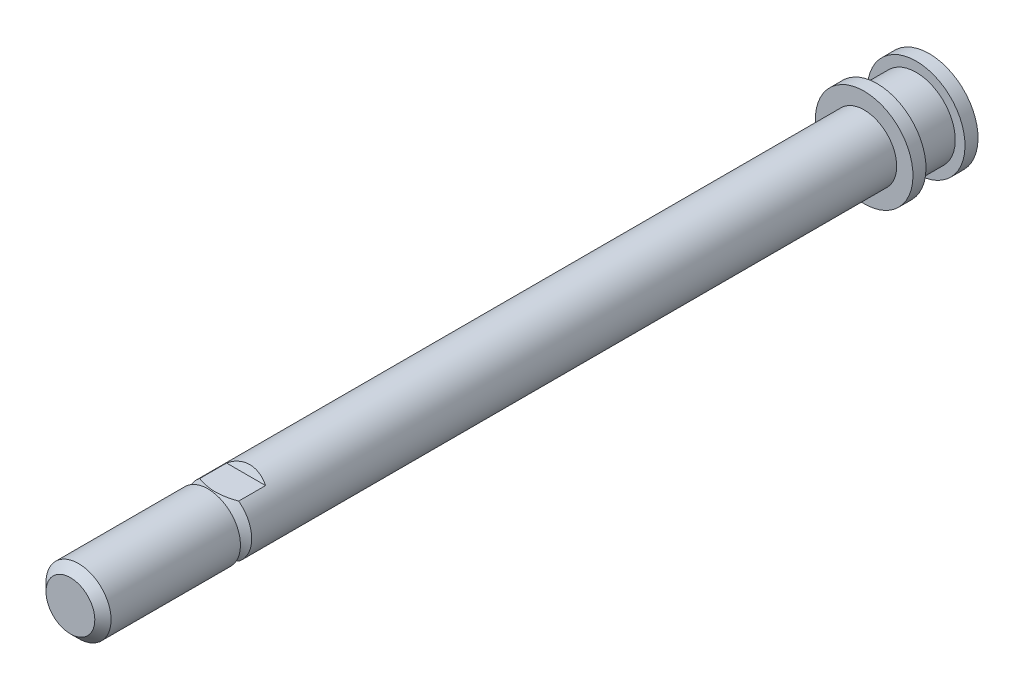
ISO-10303-21;
HEADER;
FILE_DESCRIPTION(('STEP AP214'),'2;1');
FILE_NAME('part.step','',(''),(''),'','','');
FILE_SCHEMA(('AUTOMOTIVE_DESIGN { 1 0 10303 214 1 1 1 1 }'));
ENDSEC;
DATA;
#1=APPLICATION_CONTEXT('core data for automotive mechanical design processes');
#2=APPLICATION_PROTOCOL_DEFINITION('international standard','automotive_design',2000,#1);
#3=PRODUCT_CONTEXT('',#1,'mechanical');
#4=PRODUCT('Part','Part','',(#3));
#5=PRODUCT_RELATED_PRODUCT_CATEGORY('part','',(#4));
#6=PRODUCT_DEFINITION_FORMATION('','',#4);
#7=PRODUCT_DEFINITION_CONTEXT('part definition',#1,'design');
#8=PRODUCT_DEFINITION('design','',#6,#7);
#9=PRODUCT_DEFINITION_SHAPE('','',#8);
#10=(LENGTH_UNIT() NAMED_UNIT(*) SI_UNIT(.MILLI.,.METRE.));
#11=(NAMED_UNIT(*) PLANE_ANGLE_UNIT() SI_UNIT($,.RADIAN.));
#12=(NAMED_UNIT(*) SI_UNIT($,.STERADIAN.) SOLID_ANGLE_UNIT());
#13=UNCERTAINTY_MEASURE_WITH_UNIT(LENGTH_MEASURE(1.E-05),#10,'distance_accuracy_value','');
#14=(GEOMETRIC_REPRESENTATION_CONTEXT(3) GLOBAL_UNCERTAINTY_ASSIGNED_CONTEXT((#13)) GLOBAL_UNIT_ASSIGNED_CONTEXT((#10,
#11,#12)) REPRESENTATION_CONTEXT('',''));
#15=CARTESIAN_POINT('',(0.,0.,0.));
#16=DIRECTION('',(0.,0.,1.));
#17=DIRECTION('',(1.,0.,0.));
#18=AXIS2_PLACEMENT_3D('',#15,#16,#17);
#19=CARTESIAN_POINT('',(0.,5.99999999999999,-102.));
#20=DIRECTION('',(0.,0.,-0.999999999999997));
#21=DIRECTION('',(0.,0.999999999999998,0.));
#22=AXIS2_PLACEMENT_3D('',#19,#20,#21);
#23=PLANE('',#22);
#24=CARTESIAN_POINT('',(0.,0.,-102.));
#25=DIRECTION('',(0.,0.,-0.999999999999997));
#26=DIRECTION('',(0.,0.999999999999998,0.));
#27=AXIS2_PLACEMENT_3D('',#24,#25,#26);
#28=CIRCLE('',#27,7.50000000000001);
#29=CARTESIAN_POINT('',(0.,7.5,-102.));
#30=VERTEX_POINT('',#29);
#31=EDGE_CURVE('E160',#30,#30,#28,.T.);
#32=ORIENTED_EDGE('',*,*,#31,.T.);
#33=EDGE_LOOP('',(#32));
#34=FACE_BOUND('',#33,.T.);
#35=CARTESIAN_POINT('',(0.,0.,-102.));
#36=DIRECTION('',(0.,0.,-0.999999999999997));
#37=DIRECTION('',(0.,0.999999999999998,0.));
#38=AXIS2_PLACEMENT_3D('',#35,#36,#37);
#39=CIRCLE('',#38,6.00000000000001);
#40=CARTESIAN_POINT('',(0.,6.,-102.));
#41=VERTEX_POINT('',#40);
#42=EDGE_CURVE('E248',#41,#41,#39,.T.);
#43=ORIENTED_EDGE('',*,*,#42,.F.);
#44=EDGE_LOOP('',(#43));
#45=FACE_BOUND('',#44,.T.);
#46=ADVANCED_FACE('F43',(#34,#45),#23,.T.);
#47=CARTESIAN_POINT('',(0.,0.,21.9999999999999));
#48=DIRECTION('',(0.,0.,-0.999999999999997));
#49=DIRECTION('',(0.,0.999999999999998,0.));
#50=AXIS2_PLACEMENT_3D('',#47,#48,#49);
#51=CYLINDRICAL_SURFACE('',#50,6.00000000000001);
#52=ORIENTED_EDGE('',*,*,#42,.T.);
#53=EDGE_LOOP('',(#52));
#54=FACE_BOUND('',#53,.T.);
#55=CARTESIAN_POINT('',(0.,0.,-108.));
#56=DIRECTION('',(0.,0.,-0.999999999999997));
#57=DIRECTION('',(0.,0.999999999999998,0.));
#58=AXIS2_PLACEMENT_3D('',#55,#56,#57);
#59=CIRCLE('',#58,6.00000000000001);
#60=CARTESIAN_POINT('',(0.,6.,-108.));
#61=VERTEX_POINT('',#60);
#62=EDGE_CURVE('E245',#61,#61,#59,.T.);
#63=ORIENTED_EDGE('',*,*,#62,.F.);
#64=EDGE_LOOP('',(#63));
#65=FACE_BOUND('',#64,.T.);
#66=ADVANCED_FACE('F183',(#54,#65),#51,.T.);
#67=CARTESIAN_POINT('',(0.,5.99999999999998,-108.));
#68=DIRECTION('',(0.,0.,0.999999999999997));
#69=DIRECTION('',(0.,-0.999999999999998,0.));
#70=AXIS2_PLACEMENT_3D('',#67,#68,#69);
#71=PLANE('',#70);
#72=ORIENTED_EDGE('',*,*,#62,.T.);
#73=EDGE_LOOP('',(#72));
#74=FACE_BOUND('',#73,.T.);
#75=CARTESIAN_POINT('',(0.,0.,-108.));
#76=DIRECTION('',(0.,0.,-0.999999999999997));
#77=DIRECTION('',(0.,0.999999999999998,0.));
#78=AXIS2_PLACEMENT_3D('',#75,#76,#77);
#79=CIRCLE('',#78,7.50000000000001);
#80=CARTESIAN_POINT('',(0.,7.5,-108.));
#81=VERTEX_POINT('',#80);
#82=EDGE_CURVE('E226',#81,#81,#79,.T.);
#83=ORIENTED_EDGE('',*,*,#82,.F.);
#84=EDGE_LOOP('',(#83));
#85=FACE_BOUND('',#84,.T.);
#86=ADVANCED_FACE('F188',(#74,#85),#71,.T.);
#87=CARTESIAN_POINT('',(0.,0.,21.9999999999999));
#88=DIRECTION('',(0.,0.,-0.999999999999997));
#89=DIRECTION('',(0.,0.999999999999998,0.));
#90=AXIS2_PLACEMENT_3D('',#87,#88,#89);
#91=CYLINDRICAL_SURFACE('',#90,7.50000000000001);
#92=ORIENTED_EDGE('',*,*,#82,.T.);
#93=EDGE_LOOP('',(#92));
#94=FACE_BOUND('',#93,.T.);
#95=CARTESIAN_POINT('',(0.,0.,-110.));
#96=DIRECTION('',(0.,0.,-0.999999999999997));
#97=DIRECTION('',(0.,0.999999999999998,0.));
#98=AXIS2_PLACEMENT_3D('',#95,#96,#97);
#99=CIRCLE('',#98,7.50000000000001);
#100=CARTESIAN_POINT('',(0.,7.5,-110.));
#101=VERTEX_POINT('',#100);
#102=EDGE_CURVE('E222',#101,#101,#99,.T.);
#103=ORIENTED_EDGE('',*,*,#102,.F.);
#104=EDGE_LOOP('',(#103));
#105=FACE_BOUND('',#104,.T.);
#106=ADVANCED_FACE('F196',(#94,#105),#91,.T.);
#107=CARTESIAN_POINT('',(0.,7.49999999999999,-109.999999999999));
#108=DIRECTION('',(0.,0.,-0.999999999999997));
#109=DIRECTION('',(0.,0.999999999999998,0.));
#110=AXIS2_PLACEMENT_3D('',#107,#108,#109);
#111=PLANE('',#110);
#112=ORIENTED_EDGE('',*,*,#102,.T.);
#113=EDGE_LOOP('',(#112));
#114=FACE_BOUND('',#113,.T.);
#115=ADVANCED_FACE('F200',(#114),#111,.T.);
#116=CARTESIAN_POINT('',(0.,4.99999999999996,21.9999999999999));
#117=DIRECTION('',(0.,0.,0.999999999999997));
#118=DIRECTION('',(0.,-0.999999999999998,0.));
#119=AXIS2_PLACEMENT_3D('',#116,#117,#118);
#120=PLANE('',#119);
#121=CARTESIAN_POINT('',(0.,0.,21.9999999999999));
#122=DIRECTION('',(0.,0.,0.999999999999997));
#123=DIRECTION('',(0.,-0.999999999999998,0.));
#124=AXIS2_PLACEMENT_3D('',#121,#122,#123);
#125=CIRCLE('',#124,3.75);
#126=CARTESIAN_POINT('',(0.,-3.75000000000002,21.9999999999999));
#127=VERTEX_POINT('',#126);
#128=EDGE_CURVE('E251',#127,#127,#125,.T.);
#129=ORIENTED_EDGE('',*,*,#128,.T.);
#130=EDGE_LOOP('',(#129));
#131=FACE_BOUND('',#130,.T.);
#132=ADVANCED_FACE('F204',(#131),#120,.T.);
#133=CARTESIAN_POINT('',(0.,0.,21.9999999999999));
#134=DIRECTION('',(0.,0.,-0.999999999999997));
#135=DIRECTION('',(0.,0.999999999999998,0.));
#136=AXIS2_PLACEMENT_3D('',#133,#134,#135);
#137=CYLINDRICAL_SURFACE('',#136,5.);
#138=CARTESIAN_POINT('',(0.,0.,20.7499999999999));
#139=DIRECTION('',(0.,0.,0.999999999999997));
#140=DIRECTION('',(0.,-0.999999999999998,0.));
#141=AXIS2_PLACEMENT_3D('',#138,#139,#140);
#142=CIRCLE('',#141,5.);
#143=CARTESIAN_POINT('',(0.,-4.99999999999999,20.7499999999999));
#144=VERTEX_POINT('',#143);
#145=EDGE_CURVE('E218',#144,#144,#142,.F.);
#146=ORIENTED_EDGE('',*,*,#145,.T.);
#147=EDGE_LOOP('',(#146));
#148=FACE_BOUND('',#147,.T.);
#149=CARTESIAN_POINT('',(0.,0.,0.866025403784436));
#150=DIRECTION('',(0.,0.,-0.999999999999997));
#151=DIRECTION('',(0.,0.999999999999998,0.));
#152=AXIS2_PLACEMENT_3D('',#149,#150,#151);
#153=CIRCLE('',#152,5.);
#154=CARTESIAN_POINT('',(0.,4.99999999999996,0.866025403784436));
#155=VERTEX_POINT('',#154);
#156=EDGE_CURVE('E113',#155,#155,#153,.T.);
#157=ORIENTED_EDGE('',*,*,#156,.F.);
#158=EDGE_LOOP('',(#157));
#159=FACE_BOUND('',#158,.T.);
#160=ADVANCED_FACE('F207',(#148,#159),#137,.T.);
#161=CARTESIAN_POINT('',(0.,0.,0.));
#162=DIRECTION('',(0.,0.,0.999999999999997));
#163=DIRECTION('',(0.,-0.999999999999998,0.));
#164=AXIS2_PLACEMENT_3D('',#161,#162,#163);
#165=CONICAL_SURFACE('',#164,3.5,1.0471975511966);
#166=ORIENTED_EDGE('',*,*,#156,.T.);
#167=EDGE_LOOP('',(#166));
#168=FACE_BOUND('',#167,.T.);
#169=CARTESIAN_POINT('',(0.,0.,0.));
#170=DIRECTION('',(0.,0.,-0.999999999999997));
#171=DIRECTION('',(0.,0.999999999999998,0.));
#172=AXIS2_PLACEMENT_3D('',#169,#170,#171);
#173=CIRCLE('',#172,3.5);
#174=CARTESIAN_POINT('',(0.,3.49999999999999,0.));
#175=VERTEX_POINT('',#174);
#176=EDGE_CURVE('E106',#175,#175,#173,.T.);
#177=ORIENTED_EDGE('',*,*,#176,.F.);
#178=EDGE_LOOP('',(#177));
#179=FACE_BOUND('',#178,.T.);
#180=ADVANCED_FACE('F150',(#168,#179),#165,.T.);
#181=CARTESIAN_POINT('',(0.,0.,-0.866025403784436));
#182=DIRECTION('',(0.,0.,-0.999999999999997));
#183=DIRECTION('',(0.,0.999999999999998,0.));
#184=AXIS2_PLACEMENT_3D('',#181,#182,#183);
#185=CONICAL_SURFACE('',#184,5.,1.0471975511966);
#186=CARTESIAN_POINT('',(-7.86180531631576,-3.99999999999999,-3.07201342650786));
#187=CARTESIAN_POINT('',(-7.66849783291229,-4.,-2.97255785903638));
#188=CARTESIAN_POINT('',(-7.47489348324044,-4.,-2.87367352660735));
#189=CARTESIAN_POINT('',(-7.08693733130927,-4.,-2.67735283423473));
#190=CARTESIAN_POINT('',(-6.89258548316763,-4.,-2.57991656501987));
#191=CARTESIAN_POINT('',(-6.50253870557746,-4.,-2.3865790063191));
#192=CARTESIAN_POINT('',(-6.30684167537375,-4.,-2.29068194658669));
#193=CARTESIAN_POINT('',(-5.91438194712675,-4.,-2.10110016384248));
#194=CARTESIAN_POINT('',(-5.71761927144131,-4.,-2.00741539463491));
#195=CARTESIAN_POINT('',(-5.31188234613882,-4.,-1.81772586953452));
#196=CARTESIAN_POINT('',(-5.10283407662063,-4.,-1.72187894602038));
#197=CARTESIAN_POINT('',(-4.68294809460555,-4.,-1.53419232714763));
#198=CARTESIAN_POINT('',(-4.4721104566303,-4.,-1.44235246587611));
#199=CARTESIAN_POINT('',(-4.04839019523099,-4.,-1.26400841550776));
#200=CARTESIAN_POINT('',(-3.83550945250582,-4.,-1.17749977872146));
#201=CARTESIAN_POINT('',(-3.40703640498029,-4.,-1.01147021946431));
#202=CARTESIAN_POINT('',(-3.19144446602495,-4.,-0.93194836553082));
#203=CARTESIAN_POINT('',(-2.86682003418749,-4.,-0.820122790813222));
#204=CARTESIAN_POINT('',(-2.75900888063991,-4.,-0.784269612933996));
#205=CARTESIAN_POINT('',(-2.54254458871374,-4.,-0.715231164220834));
#206=CARTESIAN_POINT('',(-2.4338915384743,-4.,-0.682045618138763));
#207=CARTESIAN_POINT('',(-2.21569487510074,-4.,-0.618744655010836));
#208=CARTESIAN_POINT('',(-2.10615131658531,-4.,-0.588629051183516));
#209=CARTESIAN_POINT('',(-1.88612589337538,-4.,-0.531904383792931));
#210=CARTESIAN_POINT('',(-1.77564371074434,-4.,-0.505296563284953));
#211=CARTESIAN_POINT('',(-1.44711223291784,-4.,-0.432426746940943));
#212=CARTESIAN_POINT('',(-1.22772857108909,-4.,-0.391851475925098));
#213=CARTESIAN_POINT('',(-0.896718914259909,-4.,-0.345186425852213));
#214=CARTESIAN_POINT('',(-0.78606530877941,-4.,-0.331998008184884));
#215=CARTESIAN_POINT('',(-0.564275526815935,-4.00000000000001,-0.310687180977873));
#216=CARTESIAN_POINT('',(-0.453139407237403,-4.00000000000002,-0.302564189565984));
#217=CARTESIAN_POINT('',(-0.207986106995854,-4.00000000000002,-0.290513192238038));
#218=CARTESIAN_POINT('',(-0.0739085918515131,-4.00000000000001,-0.287773095122356));
#219=CARTESIAN_POINT('',(0.194164625889308,-4.,-0.290098979540162));
#220=CARTESIAN_POINT('',(0.328160334374401,-4.,-0.295164310324421));
#221=CARTESIAN_POINT('',(0.595679766821111,-4.,-0.312881287785485));
#222=CARTESIAN_POINT('',(0.729203352618719,-4.,-0.3255349957655));
#223=CARTESIAN_POINT('',(0.9953865189933,-4.,-0.357919123345342));
#224=CARTESIAN_POINT('',(1.12804604919258,-4.,-0.377649951873316));
#225=CARTESIAN_POINT('',(1.39584151797719,-4.,-0.424106338324262));
#226=CARTESIAN_POINT('',(1.53094669116172,-4.,-0.451007526348123));
#227=CARTESIAN_POINT('',(1.79984416307208,-4.,-0.510678528461073));
#228=CARTESIAN_POINT('',(1.93363644000737,-4.,-0.54344843978193));
#229=CARTESIAN_POINT('',(2.19993298599708,-4.,-0.614022519162697));
#230=CARTESIAN_POINT('',(2.33243672851021,-4.,-0.651828659510102));
#231=CARTESIAN_POINT('',(2.59614009587179,-4.,-0.731688565375959));
#232=CARTESIAN_POINT('',(2.72733979406205,-4.00000000000001,-0.773742090511944));
#233=CARTESIAN_POINT('',(3.1040542951842,-4.00000000000002,-0.900171474432146));
#234=CARTESIAN_POINT('',(3.34804582505432,-4.00000000000001,-0.989083401695573));
#235=CARTESIAN_POINT('',(3.83256488220362,-3.99999999999999,-1.17594439660714));
#236=CARTESIAN_POINT('',(4.07309137139441,-4.,-1.27389610995749));
#237=CARTESIAN_POINT('',(4.55159278263701,-4.,-1.47644059627485));
#238=CARTESIAN_POINT('',(4.78956498601692,-4.,-1.58103975594987));
#239=CARTESIAN_POINT('',(5.26329012994213,-4.,-1.79505278662576));
#240=CARTESIAN_POINT('',(5.49904331167755,-4.,-1.90446612685284));
#241=CARTESIAN_POINT('',(5.96962544513929,-4.,-2.1272961973532));
#242=CARTESIAN_POINT('',(6.20444853422911,-4.,-2.24072526781709));
#243=CARTESIAN_POINT('',(6.67272720981115,-4.,-2.47037781090189));
#244=CARTESIAN_POINT('',(6.90618276546626,-4.,-2.58660134623705));
#245=CARTESIAN_POINT('',(7.37186635654456,-4.,-2.82115637848403));
#246=CARTESIAN_POINT('',(7.60409500728959,-4.,-2.93948665588895));
#247=CARTESIAN_POINT('',(8.06766737489045,-4.,-3.17786939778818));
#248=CARTESIAN_POINT('',(8.29901108575898,-4.,-3.2979218739085));
#249=CARTESIAN_POINT('',(8.92978307196929,-4.,-3.62763885109956));
#250=CARTESIAN_POINT('',(9.32849380885317,-4.,-3.83867539723094));
#251=CARTESIAN_POINT('',(10.1244264275237,-4.,-4.26367917496601));
#252=CARTESIAN_POINT('',(10.5216480655045,-4.,-4.47764686188963));
#253=CARTESIAN_POINT('',(11.3122185118462,-4.,-4.90622223159234));
#254=CARTESIAN_POINT('',(11.7055751827191,-4.,-5.12081542758064));
#255=CARTESIAN_POINT('',(12.4913392079775,-4.,-5.55156592816217));
#256=CARTESIAN_POINT('',(12.8837467210132,-4.,-5.76772294321015));
#257=CARTESIAN_POINT('',(13.275842529502,-4.,-5.98443895033197));
#258=B_SPLINE_CURVE_WITH_KNOTS('',3,(#186,#187,#188,#189,#190,#191,#192,#193,#194,#195,#196,
#197,#198,#199,#200,#201,#202,#203,#204,#205,#206,#207,#208,#209,#210,#211,#212,#213,#214,#215,
#216,#217,#218,#219,#220,#221,#222,#223,#224,#225,#226,#227,#228,#229,#230,#231,#232,#233,#234,
#235,#236,#237,#238,#239,#240,#241,#242,#243,#244,#245,#246,#247,#248,#249,#250,#251,#252,#253,
#254,#255,#256,#257),.UNSPECIFIED.,.F.,.F.,(4,2,2,2,2,2,2,2,2,2,2,2,2,2,2,2,2,2,2,2,2,2,2,2,2,2,
2,2,2,2,2,2,2,2,2,4),(0.,0.652178377651929,1.30439744686113,1.95817681455673,2.6119425183218,
3.30183146549103,3.9916918205601,4.68096862806632,5.37015340281094,5.71097459331717,
6.05176057239241,6.39252580497224,6.73341147198056,7.40190457244856,7.73611934083634,
8.07029571045641,8.47238061827976,8.87443200554661,9.2765926553639,9.67877654645681,
10.0918978777005,10.5050260540844,10.9183164979428,11.3315835645535,12.110357904853,
12.8893608986795,13.6691239989688,14.4488013430627,15.2311280312179,16.0134722930095,
16.7953775329858,17.5772880538426,18.9306202416031,20.2841650934655,21.6284143413515,
22.9724207621547),.UNSPECIFIED.);
#259=CARTESIAN_POINT('',(3.00000000000002,-4.,-0.866025403784436));
#260=VERTEX_POINT('',#259);
#261=CARTESIAN_POINT('',(-2.99999999999998,-4.,-0.866025403784436));
#262=VERTEX_POINT('',#261);
#263=EDGE_CURVE('E95',#260,#262,#258,.F.);
#264=ORIENTED_EDGE('',*,*,#263,.F.);
#265=CARTESIAN_POINT('',(0.,0.,-0.866025403784436));
#266=DIRECTION('',(0.,0.,-0.999999999999997));
#267=DIRECTION('',(0.,0.999999999999998,0.));
#268=AXIS2_PLACEMENT_3D('',#265,#266,#267);
#269=CIRCLE('',#268,5.);
#270=CARTESIAN_POINT('',(3.00000000000002,3.99999999999998,-0.866025403784436));
#271=VERTEX_POINT('',#270);
#272=EDGE_CURVE('E101',#271,#260,#269,.T.);
#273=ORIENTED_EDGE('',*,*,#272,.F.);
#274=CARTESIAN_POINT('',(-7.86180531631581,3.99999999999999,-3.07201342650781));
#275=CARTESIAN_POINT('',(-7.66849783291232,4.,-2.97255785903637));
#276=CARTESIAN_POINT('',(-7.47489348324046,4.,-2.87367352660735));
#277=CARTESIAN_POINT('',(-7.08693733130929,4.00000000000001,-2.67735283423475));
#278=CARTESIAN_POINT('',(-6.89258548316764,4.,-2.57991656501989));
#279=CARTESIAN_POINT('',(-6.50253870557748,4.,-2.38657900631911));
#280=CARTESIAN_POINT('',(-6.30684167537378,4.,-2.2906819465867));
#281=CARTESIAN_POINT('',(-5.91438194712677,4.,-2.10110016384249));
#282=CARTESIAN_POINT('',(-5.71761927144133,4.,-2.00741539463492));
#283=CARTESIAN_POINT('',(-5.31188234613884,4.,-1.81772586953453));
#284=CARTESIAN_POINT('',(-5.10283407662065,4.,-1.72187894602039));
#285=CARTESIAN_POINT('',(-4.68294809460558,4.,-1.53419232714765));
#286=CARTESIAN_POINT('',(-4.47211045663033,4.,-1.44235246587612));
#287=CARTESIAN_POINT('',(-4.04839019523102,4.00000000000001,-1.26400841550778));
#288=CARTESIAN_POINT('',(-3.83550945250585,4.00000000000001,-1.17749977872148));
#289=CARTESIAN_POINT('',(-3.40703640498033,4.,-1.01147021946432));
#290=CARTESIAN_POINT('',(-3.19144446602499,3.99999999999998,-0.931948365530815));
#291=CARTESIAN_POINT('',(-2.86682003418753,3.99999999999999,-0.820122790813223));
#292=CARTESIAN_POINT('',(-2.75900888063994,4.,-0.784269612934004));
#293=CARTESIAN_POINT('',(-2.54254458871377,4.00000000000001,-0.715231164220846));
#294=CARTESIAN_POINT('',(-2.43389153847433,4.,-0.682045618138772));
#295=CARTESIAN_POINT('',(-2.21569487510076,4.,-0.618744655010842));
#296=CARTESIAN_POINT('',(-2.10615131658533,4.,-0.588629051183522));
#297=CARTESIAN_POINT('',(-1.88612589337539,4.,-0.531904383792935));
#298=CARTESIAN_POINT('',(-1.77564371074435,4.,-0.505296563284956));
#299=CARTESIAN_POINT('',(-1.44711223291784,4.,-0.432426746940945));
#300=CARTESIAN_POINT('',(-1.22772857108909,4.,-0.391851475925099));
#301=CARTESIAN_POINT('',(-0.896718914259895,4.00000000000001,-0.345186425852213));
#302=CARTESIAN_POINT('',(-0.786065308779394,4.00000000000001,-0.331998008184883));
#303=CARTESIAN_POINT('',(-0.564275526815913,3.99999999999999,-0.310687180977873));
#304=CARTESIAN_POINT('',(-0.453139407237378,3.99999999999996,-0.302564189565984));
#305=CARTESIAN_POINT('',(-0.207986106995827,3.99999999999996,-0.290513192238038));
#306=CARTESIAN_POINT('',(-0.0739085918514866,3.99999999999999,-0.287773095122357));
#307=CARTESIAN_POINT('',(0.194164625889334,4.00000000000002,-0.290098979540164));
#308=CARTESIAN_POINT('',(0.328160334374426,4.00000000000001,-0.295164310324423));
#309=CARTESIAN_POINT('',(0.595679766821135,4.,-0.312881287785488));
#310=CARTESIAN_POINT('',(0.729203352618742,4.,-0.325534995765504));
#311=CARTESIAN_POINT('',(0.995386518993322,4.00000000000001,-0.357919123345347));
#312=CARTESIAN_POINT('',(1.1280460491926,4.,-0.377649951873321));
#313=CARTESIAN_POINT('',(1.39584151797721,4.,-0.424106338324267));
#314=CARTESIAN_POINT('',(1.53094669116174,4.,-0.451007526348128));
#315=CARTESIAN_POINT('',(1.79984416307209,4.,-0.510678528461078));
#316=CARTESIAN_POINT('',(1.93363644000739,4.,-0.543448439781935));
#317=CARTESIAN_POINT('',(2.19993298599709,4.00000000000001,-0.614022519162701));
#318=CARTESIAN_POINT('',(2.33243672851022,4.00000000000001,-0.651828659510107));
#319=CARTESIAN_POINT('',(2.5961400958718,4.,-0.731688565375963));
#320=CARTESIAN_POINT('',(2.72733979406206,3.99999999999998,-0.773742090511945));
#321=CARTESIAN_POINT('',(3.10405429518421,3.99999999999997,-0.900171474432144));
#322=CARTESIAN_POINT('',(3.34804582505433,3.99999999999999,-0.989083401695575));
#323=CARTESIAN_POINT('',(3.83256488220362,4.00000000000002,-1.17594439660715));
#324=CARTESIAN_POINT('',(4.07309137139441,4.00000000000001,-1.27389610995749));
#325=CARTESIAN_POINT('',(4.55159278263701,4.,-1.47644059627485));
#326=CARTESIAN_POINT('',(4.78956498601692,4.,-1.58103975594986));
#327=CARTESIAN_POINT('',(5.26329012994212,4.00000000000001,-1.79505278662576));
#328=CARTESIAN_POINT('',(5.49904331167754,4.00000000000001,-1.90446612685284));
#329=CARTESIAN_POINT('',(5.96962544513928,4.00000000000001,-2.1272961973532));
#330=CARTESIAN_POINT('',(6.2044485342291,4.00000000000001,-2.24072526781709));
#331=CARTESIAN_POINT('',(6.67272720981114,4.00000000000001,-2.47037781090189));
#332=CARTESIAN_POINT('',(6.90618276546625,4.00000000000001,-2.58660134623705));
#333=CARTESIAN_POINT('',(7.37186635654455,4.00000000000001,-2.82115637848402));
#334=CARTESIAN_POINT('',(7.60409500728957,4.00000000000001,-2.93948665588895));
#335=CARTESIAN_POINT('',(8.06766737489043,4.00000000000001,-3.17786939778817));
#336=CARTESIAN_POINT('',(8.29901108575896,4.00000000000001,-3.29792187390849));
#337=CARTESIAN_POINT('',(8.92978307196927,4.00000000000001,-3.62763885109955));
#338=CARTESIAN_POINT('',(9.32849380885315,4.00000000000001,-3.83867539723093));
#339=CARTESIAN_POINT('',(10.1244264275237,4.00000000000001,-4.263679174966));
#340=CARTESIAN_POINT('',(10.5216480655045,4.00000000000001,-4.47764686188962));
#341=CARTESIAN_POINT('',(11.3122185118462,4.00000000000001,-4.90622223159233));
#342=CARTESIAN_POINT('',(11.7055751827191,4.00000000000001,-5.12081542758064));
#343=CARTESIAN_POINT('',(12.4913392079775,4.00000000000001,-5.55156592816216));
#344=CARTESIAN_POINT('',(12.8837467210132,4.,-5.76772294321013));
#345=CARTESIAN_POINT('',(13.275842529502,3.99999999999999,-5.98443895033193));
#346=B_SPLINE_CURVE_WITH_KNOTS('',3,(#274,#275,#276,#277,#278,#279,#280,#281,#282,#283,#284,
#285,#286,#287,#288,#289,#290,#291,#292,#293,#294,#295,#296,#297,#298,#299,#300,#301,#302,#303,
#304,#305,#306,#307,#308,#309,#310,#311,#312,#313,#314,#315,#316,#317,#318,#319,#320,#321,#322,
#323,#324,#325,#326,#327,#328,#329,#330,#331,#332,#333,#334,#335,#336,#337,#338,#339,#340,#341,
#342,#343,#344,#345),.UNSPECIFIED.,.F.,.F.,(4,2,2,2,2,2,2,2,2,2,2,2,2,2,2,2,2,2,2,2,2,2,2,2,2,2,
2,2,2,2,2,2,2,2,2,4),(0.,0.652178377651927,1.30439744686113,1.95817681455672,2.61194251832179,
3.30183146549102,3.99169182056009,4.6809686280663,5.37015340281091,5.71097459331715,
6.05176057239241,6.39252580497225,6.73341147198057,7.40190457244859,7.73611934083638,
8.07029571045646,8.4723806182798,8.87443200554666,9.27659265536394,9.67877654645685,
10.0918978777006,10.5050260540844,10.9183164979428,11.3315835645535,12.110357904853,
12.8893608986796,13.6691239989688,14.4488013430627,15.2311280312179,16.0134722930095,
16.7953775329858,17.5772880538426,18.9306202416031,20.2841650934655,21.6284143413515,
22.9724207621547),.UNSPECIFIED.);
#347=CARTESIAN_POINT('',(-2.99999999999996,3.99999999999996,-0.866025403784436));
#348=VERTEX_POINT('',#347);
#349=EDGE_CURVE('E66',#348,#271,#346,.T.);
#350=ORIENTED_EDGE('',*,*,#349,.F.);
#351=EDGE_CURVE('E107',#262,#348,#269,.T.);
#352=ORIENTED_EDGE('',*,*,#351,.F.);
#353=EDGE_LOOP('',(#264,#273,#350,#352));
#354=FACE_BOUND('',#353,.T.);
#355=ORIENTED_EDGE('',*,*,#176,.T.);
#356=EDGE_LOOP('',(#355));
#357=FACE_BOUND('',#356,.T.);
#358=ADVANCED_FACE('F145',(#354,#357),#185,.T.);
#359=CARTESIAN_POINT('',(0.,0.,21.9999999999999));
#360=DIRECTION('',(0.,0.,-0.999999999999997));
#361=DIRECTION('',(0.,0.999999999999998,0.));
#362=AXIS2_PLACEMENT_3D('',#359,#360,#361);
#363=CYLINDRICAL_SURFACE('',#362,5.);
#364=DIRECTION('',(0.,0.,-0.999999999999997));
#365=VECTOR('',#364,1.);
#366=CARTESIAN_POINT('',(3.00000000000004,-4.,21.9999999999999));
#367=LINE('',#366,#365);
#368=CARTESIAN_POINT('',(3.00000000000002,-3.99999999999999,-5.));
#369=VERTEX_POINT('',#368);
#370=EDGE_CURVE('E12',#369,#260,#367,.F.);
#371=ORIENTED_EDGE('',*,*,#370,.F.);
#372=CARTESIAN_POINT('',(0.,0.,-2.69059892324151));
#373=DIRECTION('',(0.,0.499999999999997,-0.866025403784437));
#374=DIRECTION('',(0.,-0.866025403784438,-0.499999999999996));
#375=AXIS2_PLACEMENT_3D('',#372,#373,#374);
#376=ELLIPSE('',#375,5.77350269189625,5.);
#377=CARTESIAN_POINT('',(-2.99999999999998,-4.,-5.));
#378=VERTEX_POINT('',#377);
#379=EDGE_CURVE('E83',#378,#369,#376,.F.);
#380=ORIENTED_EDGE('',*,*,#379,.F.);
#381=DIRECTION('',(0.,0.,-0.999999999999997));
#382=VECTOR('',#381,1.);
#383=CARTESIAN_POINT('',(-2.99999999999995,-4.00000000000002,21.9999999999999));
#384=LINE('',#383,#382);
#385=EDGE_CURVE('E52',#262,#378,#384,.T.);
#386=ORIENTED_EDGE('',*,*,#385,.F.);
#387=ORIENTED_EDGE('',*,*,#351,.T.);
#388=DIRECTION('',(0.,0.,-0.999999999999997));
#389=VECTOR('',#388,1.);
#390=CARTESIAN_POINT('',(-2.99999999999995,3.99999999999994,21.9999999999999));
#391=LINE('',#390,#389);
#392=CARTESIAN_POINT('',(-2.99999999999997,3.99999999999998,-5.));
#393=VERTEX_POINT('',#392);
#394=EDGE_CURVE('E89',#393,#348,#391,.F.);
#395=ORIENTED_EDGE('',*,*,#394,.F.);
#396=CARTESIAN_POINT('',(0.,0.,-2.69059892324151));
#397=DIRECTION('',(0.,-0.499999999999997,-0.866025403784437));
#398=DIRECTION('',(0.,0.866025403784438,-0.499999999999996));
#399=AXIS2_PLACEMENT_3D('',#396,#397,#398);
#400=ELLIPSE('',#399,5.77350269189625,5.);
#401=CARTESIAN_POINT('',(3.00000000000002,3.99999999999996,-5.));
#402=VERTEX_POINT('',#401);
#403=EDGE_CURVE('E253',#402,#393,#400,.F.);
#404=ORIENTED_EDGE('',*,*,#403,.F.);
#405=DIRECTION('',(0.,0.,-0.999999999999997));
#406=VECTOR('',#405,1.);
#407=CARTESIAN_POINT('',(3.00000000000001,3.99999999999998,21.9999999999999));
#408=LINE('',#407,#406);
#409=EDGE_CURVE('E103',#271,#402,#408,.T.);
#410=ORIENTED_EDGE('',*,*,#409,.F.);
#411=ORIENTED_EDGE('',*,*,#272,.T.);
#412=EDGE_LOOP('',(#371,#380,#386,#387,#395,#404,#410,#411));
#413=FACE_BOUND('',#412,.T.);
#414=CARTESIAN_POINT('',(0.,0.,-99.9999999999996));
#415=DIRECTION('',(0.,0.,-0.999999999999997));
#416=DIRECTION('',(0.,0.999999999999998,0.));
#417=AXIS2_PLACEMENT_3D('',#414,#415,#416);
#418=CIRCLE('',#417,5.);
#419=CARTESIAN_POINT('',(0.,4.99999999999999,-99.9999999999996));
#420=VERTEX_POINT('',#419);
#421=EDGE_CURVE('E116',#420,#420,#418,.T.);
#422=ORIENTED_EDGE('',*,*,#421,.F.);
#423=EDGE_LOOP('',(#422));
#424=FACE_BOUND('',#423,.T.);
#425=ADVANCED_FACE('F98',(#413,#424),#363,.T.);
#426=CARTESIAN_POINT('',(0.,4.99999999999997,-99.9999999999996));
#427=DIRECTION('',(0.,0.,0.999999999999997));
#428=DIRECTION('',(0.,-0.999999999999998,0.));
#429=AXIS2_PLACEMENT_3D('',#426,#427,#428);
#430=PLANE('',#429);
#431=ORIENTED_EDGE('',*,*,#421,.T.);
#432=EDGE_LOOP('',(#431));
#433=FACE_BOUND('',#432,.T.);
#434=CARTESIAN_POINT('',(0.,0.,-99.9999999999996));
#435=DIRECTION('',(0.,0.,-0.999999999999997));
#436=DIRECTION('',(0.,0.999999999999998,0.));
#437=AXIS2_PLACEMENT_3D('',#434,#435,#436);
#438=CIRCLE('',#437,7.50000000000001);
#439=CARTESIAN_POINT('',(0.,7.5,-99.9999999999996));
#440=VERTEX_POINT('',#439);
#441=EDGE_CURVE('E234',#440,#440,#438,.T.);
#442=ORIENTED_EDGE('',*,*,#441,.F.);
#443=EDGE_LOOP('',(#442));
#444=FACE_BOUND('',#443,.T.);
#445=ADVANCED_FACE('F173',(#433,#444),#430,.T.);
#446=CARTESIAN_POINT('',(0.,0.,21.9999999999999));
#447=DIRECTION('',(0.,0.,-0.999999999999997));
#448=DIRECTION('',(0.,0.999999999999998,0.));
#449=AXIS2_PLACEMENT_3D('',#446,#447,#448);
#450=CYLINDRICAL_SURFACE('',#449,7.50000000000001);
#451=ORIENTED_EDGE('',*,*,#441,.T.);
#452=EDGE_LOOP('',(#451));
#453=FACE_BOUND('',#452,.T.);
#454=ORIENTED_EDGE('',*,*,#31,.F.);
#455=EDGE_LOOP('',(#454));
#456=FACE_BOUND('',#455,.T.);
#457=ADVANCED_FACE('F171',(#453,#456),#450,.T.);
#458=CARTESIAN_POINT('',(0.,0.,20.7499999999999));
#459=DIRECTION('',(0.,0.,-0.999999999999997));
#460=DIRECTION('',(0.,0.999999999999998,0.));
#461=AXIS2_PLACEMENT_3D('',#458,#459,#460);
#462=CONICAL_SURFACE('',#461,5.,0.785398163397447);
#463=ORIENTED_EDGE('',*,*,#128,.F.);
#464=EDGE_LOOP('',(#463));
#465=FACE_BOUND('',#464,.T.);
#466=ORIENTED_EDGE('',*,*,#145,.F.);
#467=EDGE_LOOP('',(#466));
#468=FACE_BOUND('',#467,.T.);
#469=ADVANCED_FACE('F45',(#465,#468),#462,.T.);
#470=CARTESIAN_POINT('',(-7.49999999999994,4.99999999999999,-5.57735026918957));
#471=DIRECTION('',(0.,-0.499999999999997,-0.866025403784437));
#472=DIRECTION('',(0.,0.866025403784438,-0.499999999999996));
#473=AXIS2_PLACEMENT_3D('',#470,#471,#472);
#474=PLANE('',#473);
#475=ORIENTED_EDGE('',*,*,#403,.T.);
#476=DIRECTION('',(0.999999999999998,0.,0.));
#477=VECTOR('',#476,1.);
#478=CARTESIAN_POINT('',(-7.50000000000001,4.,-4.99999999999994));
#479=LINE('',#478,#477);
#480=EDGE_CURVE('E140',#393,#402,#479,.T.);
#481=ORIENTED_EDGE('',*,*,#480,.T.);
#482=EDGE_LOOP('',(#475,#481));
#483=FACE_BOUND('',#482,.T.);
#484=ADVANCED_FACE('F167',(#483),#474,.F.);
#485=CARTESIAN_POINT('',(-7.50000000000001,4.,-4.99999999999994));
#486=DIRECTION('',(0.,-0.999999999999998,0.));
#487=DIRECTION('',(0.,0.,-0.999999999999997));
#488=AXIS2_PLACEMENT_3D('',#485,#486,#487);
#489=PLANE('',#488);
#490=ORIENTED_EDGE('',*,*,#394,.T.);
#491=ORIENTED_EDGE('',*,*,#349,.T.);
#492=ORIENTED_EDGE('',*,*,#409,.T.);
#493=ORIENTED_EDGE('',*,*,#480,.F.);
#494=EDGE_LOOP('',(#490,#491,#492,#493));
#495=FACE_BOUND('',#494,.T.);
#496=ADVANCED_FACE('F163',(#495),#489,.F.);
#497=CARTESIAN_POINT('',(-7.5,-4.,-5.));
#498=DIRECTION('',(0.,0.999999999999998,0.));
#499=DIRECTION('',(0.,0.,0.999999999999997));
#500=AXIS2_PLACEMENT_3D('',#497,#498,#499);
#501=PLANE('',#500);
#502=ORIENTED_EDGE('',*,*,#370,.T.);
#503=ORIENTED_EDGE('',*,*,#263,.T.);
#504=ORIENTED_EDGE('',*,*,#385,.T.);
#505=DIRECTION('',(0.999999999999998,0.,0.));
#506=VECTOR('',#505,1.);
#507=CARTESIAN_POINT('',(-7.5,-4.,-5.));
#508=LINE('',#507,#506);
#509=EDGE_CURVE('E58',#378,#369,#508,.T.);
#510=ORIENTED_EDGE('',*,*,#509,.T.);
#511=EDGE_LOOP('',(#502,#503,#504,#510));
#512=FACE_BOUND('',#511,.T.);
#513=ADVANCED_FACE('F92',(#512),#501,.F.);
#514=CARTESIAN_POINT('',(-7.49999999999997,-4.99999999999999,-5.57735026918962));
#515=DIRECTION('',(0.,0.499999999999997,-0.866025403784437));
#516=DIRECTION('',(0.,0.866025403784438,0.499999999999996));
#517=AXIS2_PLACEMENT_3D('',#514,#515,#516);
#518=PLANE('',#517);
#519=ORIENTED_EDGE('',*,*,#379,.T.);
#520=ORIENTED_EDGE('',*,*,#509,.F.);
#521=EDGE_LOOP('',(#519,#520));
#522=FACE_BOUND('',#521,.T.);
#523=ADVANCED_FACE('F84',(#522),#518,.F.);
#524=CLOSED_SHELL('',(#46,#66,#86,#106,#115,#132,#160,#180,#358,#425,#445,#457,#469,#484,#496,
#513,#523));
#525=MANIFOLD_SOLID_BREP('B2',#524);
#526=ADVANCED_BREP_SHAPE_REPRESENTATION('',(#18,#525),#14);
#527=SHAPE_DEFINITION_REPRESENTATION(#9,#526);
ENDSEC;
END-ISO-10303-21;
